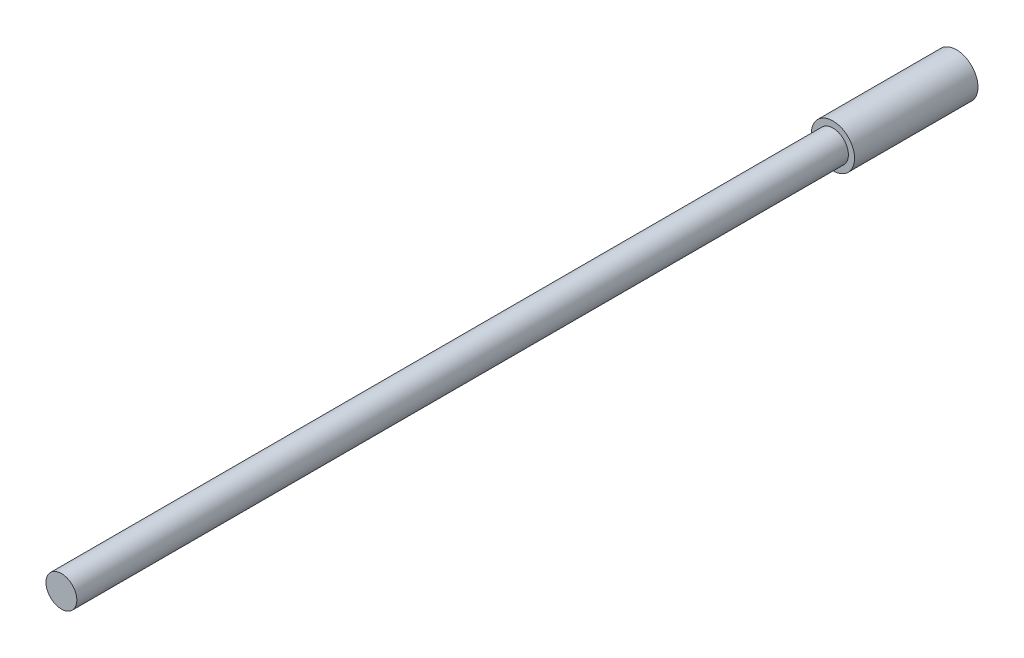
ISO-10303-21;
HEADER;
FILE_DESCRIPTION(('STEP AP214'),'2;1');
FILE_NAME('part.step','',(''),(''),'','','');
FILE_SCHEMA(('AUTOMOTIVE_DESIGN { 1 0 10303 214 1 1 1 1 }'));
ENDSEC;
DATA;
#1=APPLICATION_CONTEXT('core data for automotive mechanical design processes');
#2=APPLICATION_PROTOCOL_DEFINITION('international standard','automotive_design',2000,#1);
#3=PRODUCT_CONTEXT('',#1,'mechanical');
#4=PRODUCT('Part','Part','',(#3));
#5=PRODUCT_RELATED_PRODUCT_CATEGORY('part','',(#4));
#6=PRODUCT_DEFINITION_FORMATION('','',#4);
#7=PRODUCT_DEFINITION_CONTEXT('part definition',#1,'design');
#8=PRODUCT_DEFINITION('design','',#6,#7);
#9=PRODUCT_DEFINITION_SHAPE('','',#8);
#10=(LENGTH_UNIT() NAMED_UNIT(*) SI_UNIT(.MILLI.,.METRE.));
#11=(NAMED_UNIT(*) PLANE_ANGLE_UNIT() SI_UNIT($,.RADIAN.));
#12=(NAMED_UNIT(*) SI_UNIT($,.STERADIAN.) SOLID_ANGLE_UNIT());
#13=UNCERTAINTY_MEASURE_WITH_UNIT(LENGTH_MEASURE(1.E-05),#10,'distance_accuracy_value','');
#14=(GEOMETRIC_REPRESENTATION_CONTEXT(3) GLOBAL_UNCERTAINTY_ASSIGNED_CONTEXT((#13)) GLOBAL_UNIT_ASSIGNED_CONTEXT((#10,
#11,#12)) REPRESENTATION_CONTEXT('',''));
#15=CARTESIAN_POINT('',(0.,0.,0.));
#16=DIRECTION('',(0.,0.,1.));
#17=DIRECTION('',(1.,0.,0.));
#18=AXIS2_PLACEMENT_3D('',#15,#16,#17);
#19=CARTESIAN_POINT('',(0.,0.,5.08));
#20=DIRECTION('',(0.,0.,-1.));
#21=DIRECTION('',(-1.,0.,0.));
#22=AXIS2_PLACEMENT_3D('',#19,#20,#21);
#23=CYLINDRICAL_SURFACE('',#22,0.889);
#24=CARTESIAN_POINT('',(0.,0.,5.08));
#25=DIRECTION('',(0.,0.,1.));
#26=DIRECTION('',(1.,0.,0.));
#27=AXIS2_PLACEMENT_3D('',#24,#25,#26);
#28=CIRCLE('',#27,0.889);
#29=CARTESIAN_POINT('',(0.889,0.,5.08));
#30=VERTEX_POINT('',#29);
#31=EDGE_CURVE('E45',#30,#30,#28,.T.);
#32=ORIENTED_EDGE('',*,*,#31,.F.);
#33=EDGE_LOOP('',(#32));
#34=FACE_BOUND('',#33,.T.);
#35=CARTESIAN_POINT('',(0.,0.,0.));
#36=DIRECTION('',(0.,0.,1.));
#37=DIRECTION('',(1.,0.,0.));
#38=AXIS2_PLACEMENT_3D('',#35,#36,#37);
#39=CIRCLE('',#38,0.889);
#40=CARTESIAN_POINT('',(0.889,0.,0.));
#41=VERTEX_POINT('',#40);
#42=EDGE_CURVE('E40',#41,#41,#39,.T.);
#43=ORIENTED_EDGE('',*,*,#42,.T.);
#44=EDGE_LOOP('',(#43));
#45=FACE_BOUND('',#44,.T.);
#46=ADVANCED_FACE('F37',(#34,#45),#23,.T.);
#47=CARTESIAN_POINT('',(0.,0.,5.08));
#48=DIRECTION('',(0.,0.,1.));
#49=DIRECTION('',(1.,0.,0.));
#50=AXIS2_PLACEMENT_3D('',#47,#48,#49);
#51=PLANE('',#50);
#52=CARTESIAN_POINT('',(0.,0.,5.08));
#53=DIRECTION('',(0.,0.,1.));
#54=DIRECTION('',(1.,0.,0.));
#55=AXIS2_PLACEMENT_3D('',#52,#53,#54);
#56=CIRCLE('',#55,0.635);
#57=CARTESIAN_POINT('',(0.635,0.,5.08));
#58=VERTEX_POINT('',#57);
#59=EDGE_CURVE('E10',#58,#58,#56,.T.);
#60=ORIENTED_EDGE('',*,*,#59,.F.);
#61=EDGE_LOOP('',(#60));
#62=FACE_BOUND('',#61,.T.);
#63=ORIENTED_EDGE('',*,*,#31,.T.);
#64=EDGE_LOOP('',(#63));
#65=FACE_BOUND('',#64,.T.);
#66=ADVANCED_FACE('F65',(#62,#65),#51,.T.);
#67=CARTESIAN_POINT('',(0.,0.,0.));
#68=DIRECTION('',(0.,0.,1.));
#69=DIRECTION('',(1.,0.,0.));
#70=AXIS2_PLACEMENT_3D('',#67,#68,#69);
#71=PLANE('',#70);
#72=ORIENTED_EDGE('',*,*,#42,.F.);
#73=EDGE_LOOP('',(#72));
#74=FACE_BOUND('',#73,.T.);
#75=ADVANCED_FACE('F62',(#74),#71,.F.);
#76=CARTESIAN_POINT('',(0.,0.,36.83));
#77=DIRECTION('',(0.,0.,-1.));
#78=DIRECTION('',(-1.,0.,0.));
#79=AXIS2_PLACEMENT_3D('',#76,#77,#78);
#80=CYLINDRICAL_SURFACE('',#79,0.635);
#81=CARTESIAN_POINT('',(0.,0.,36.83));
#82=DIRECTION('',(0.,0.,1.));
#83=DIRECTION('',(1.,0.,0.));
#84=AXIS2_PLACEMENT_3D('',#81,#82,#83);
#85=CIRCLE('',#84,0.635);
#86=CARTESIAN_POINT('',(0.635,0.,36.83));
#87=VERTEX_POINT('',#86);
#88=EDGE_CURVE('E52',#87,#87,#85,.T.);
#89=ORIENTED_EDGE('',*,*,#88,.F.);
#90=EDGE_LOOP('',(#89));
#91=FACE_BOUND('',#90,.T.);
#92=ORIENTED_EDGE('',*,*,#59,.T.);
#93=EDGE_LOOP('',(#92));
#94=FACE_BOUND('',#93,.T.);
#95=ADVANCED_FACE('F64',(#91,#94),#80,.T.);
#96=CARTESIAN_POINT('',(0.,0.,36.83));
#97=DIRECTION('',(0.,0.,1.));
#98=DIRECTION('',(1.,0.,0.));
#99=AXIS2_PLACEMENT_3D('',#96,#97,#98);
#100=PLANE('',#99);
#101=ORIENTED_EDGE('',*,*,#88,.T.);
#102=EDGE_LOOP('',(#101));
#103=FACE_BOUND('',#102,.T.);
#104=ADVANCED_FACE('F70',(#103),#100,.T.);
#105=CLOSED_SHELL('',(#46,#66,#75,#95,#104));
#106=MANIFOLD_SOLID_BREP('B2',#105);
#107=ADVANCED_BREP_SHAPE_REPRESENTATION('',(#18,#106),#14);
#108=SHAPE_DEFINITION_REPRESENTATION(#9,#107);
ENDSEC;
END-ISO-10303-21;
